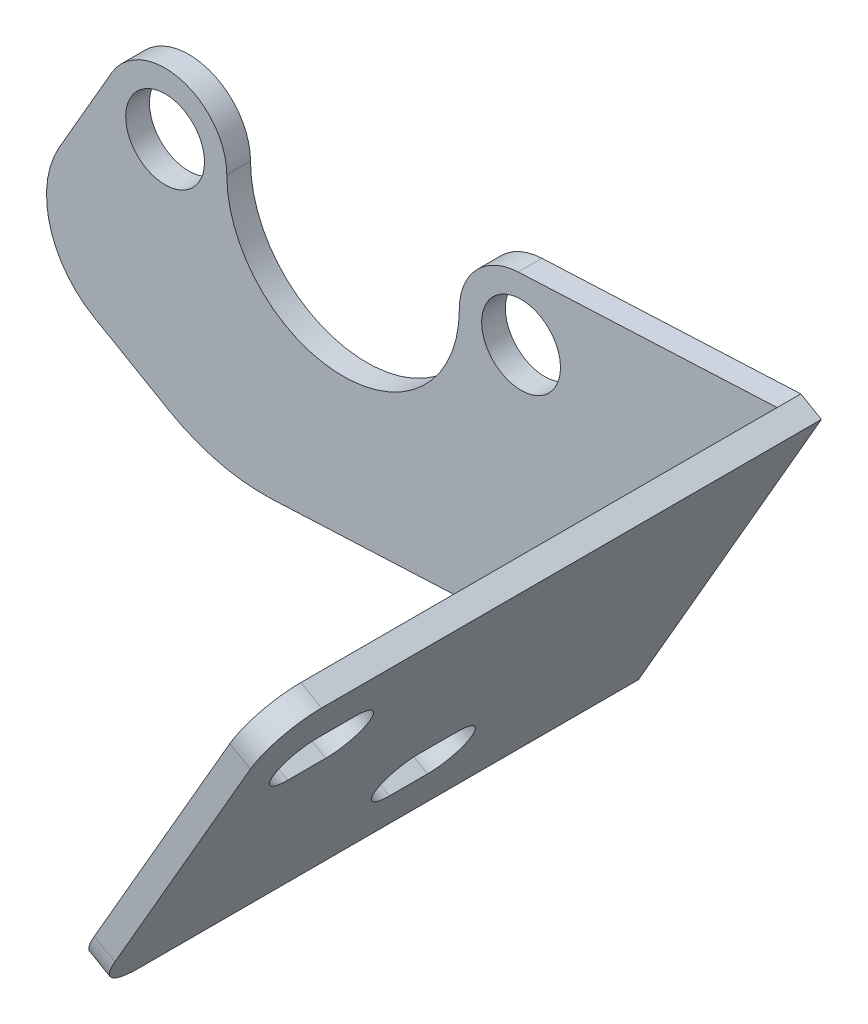
ISO-10303-21;
HEADER;
FILE_DESCRIPTION(('STEP AP214'),'2;1');
FILE_NAME('part.step','',(''),(''),'','','');
FILE_SCHEMA(('AUTOMOTIVE_DESIGN { 1 0 10303 214 1 1 1 1 }'));
ENDSEC;
DATA;
#1=APPLICATION_CONTEXT('core data for automotive mechanical design processes');
#2=APPLICATION_PROTOCOL_DEFINITION('international standard','automotive_design',2000,#1);
#3=PRODUCT_CONTEXT('',#1,'mechanical');
#4=PRODUCT('Part','Part','',(#3));
#5=PRODUCT_RELATED_PRODUCT_CATEGORY('part','',(#4));
#6=PRODUCT_DEFINITION_FORMATION('','',#4);
#7=PRODUCT_DEFINITION_CONTEXT('part definition',#1,'design');
#8=PRODUCT_DEFINITION('design','',#6,#7);
#9=PRODUCT_DEFINITION_SHAPE('','',#8);
#10=(LENGTH_UNIT() NAMED_UNIT(*) SI_UNIT(.MILLI.,.METRE.));
#11=(NAMED_UNIT(*) PLANE_ANGLE_UNIT() SI_UNIT($,.RADIAN.));
#12=(NAMED_UNIT(*) SI_UNIT($,.STERADIAN.) SOLID_ANGLE_UNIT());
#13=UNCERTAINTY_MEASURE_WITH_UNIT(LENGTH_MEASURE(1.E-05),#10,'distance_accuracy_value','');
#14=(GEOMETRIC_REPRESENTATION_CONTEXT(3) GLOBAL_UNCERTAINTY_ASSIGNED_CONTEXT((#13)) GLOBAL_UNIT_ASSIGNED_CONTEXT((#10,
#11,#12)) REPRESENTATION_CONTEXT('',''));
#15=CARTESIAN_POINT('',(0.,0.,0.));
#16=DIRECTION('',(0.,0.,1.));
#17=DIRECTION('',(1.,0.,0.));
#18=AXIS2_PLACEMENT_3D('',#15,#16,#17);
#19=CARTESIAN_POINT('',(0.0124999999997993,1.18749999999891,3.17499999999999));
#20=DIRECTION('',(0.,0.,-1.));
#21=DIRECTION('',(-1.,0.,0.));
#22=AXIS2_PLACEMENT_3D('',#19,#20,#21);
#23=PLANE('',#22);
#24=CARTESIAN_POINT('',(23.825,-0.399999999999684,3.17499999999998));
#25=DIRECTION('',(0.,0.,-1.));
#26=DIRECTION('',(-1.,0.,0.));
#27=AXIS2_PLACEMENT_3D('',#24,#25,#26);
#28=CIRCLE('',#27,5.27050000000111);
#29=CARTESIAN_POINT('',(18.5544999999989,-0.399999999999684,3.17499999999998));
#30=VERTEX_POINT('',#29);
#31=EDGE_CURVE('E340',#30,#30,#28,.T.);
#32=ORIENTED_EDGE('',*,*,#31,.T.);
#33=EDGE_LOOP('',(#32));
#34=FACE_BOUND('',#33,.T.);
#35=CARTESIAN_POINT('',(-23.8,-0.399999999999684,3.17499999999998));
#36=DIRECTION('',(0.,0.,-1.));
#37=DIRECTION('',(-1.,0.,0.));
#38=AXIS2_PLACEMENT_3D('',#35,#36,#37);
#39=CIRCLE('',#38,5.27050000000121);
#40=CARTESIAN_POINT('',(-29.0705000000012,-0.399999999999684,3.17499999999998));
#41=VERTEX_POINT('',#40);
#42=EDGE_CURVE('E284',#41,#41,#39,.T.);
#43=ORIENTED_EDGE('',*,*,#42,.T.);
#44=EDGE_LOOP('',(#43));
#45=FACE_BOUND('',#44,.T.);
#46=DIRECTION('',(-0.86602540378444,0.499999999999997,0.));
#47=VECTOR('',#46,1.);
#48=CARTESIAN_POINT('',(-19.4839165306537,-33.7471333615235,3.17499999999998));
#49=LINE('',#48,#47);
#50=CARTESIAN_POINT('',(-23.2589557120646,-31.5676134739345,3.17499999999998));
#51=VERTEX_POINT('',#50);
#52=CARTESIAN_POINT('',(-33.3112285300745,-25.763931056489,3.17499999999998));
#53=VERTEX_POINT('',#52);
#54=EDGE_CURVE('E306',#51,#53,#49,.T.);
#55=ORIENTED_EDGE('',*,*,#54,.F.);
#56=CARTESIAN_POINT('',(-10.5589557120647,-9.57056821780976,3.17499999999998));
#57=DIRECTION('',(0.,0.,-1.));
#58=DIRECTION('',(-1.,0.,0.));
#59=AXIS2_PLACEMENT_3D('',#56,#57,#58);
#60=CIRCLE('',#59,25.4);
#61=CARTESIAN_POINT('',(-9.37884668488022,-34.9431388933239,3.17499999999998));
#62=VERTEX_POINT('',#61);
#63=EDGE_CURVE('E373',#51,#62,#60,.F.);
#64=ORIENTED_EDGE('',*,*,#63,.T.);
#65=DIRECTION('',(0.998920105335201,0.0464609853222241,0.));
#66=VECTOR('',#65,1.);
#67=CARTESIAN_POINT('',(1.6014940665288,-34.4324299309559,3.17499999999998));
#68=LINE('',#67,#66);
#69=CARTESIAN_POINT('',(33.6033240868605,-32.9439860134507,3.17499999999999));
#70=VERTEX_POINT('',#69);
#71=EDGE_CURVE('E347',#62,#70,#68,.T.);
#72=ORIENTED_EDGE('',*,*,#71,.T.);
#73=DIRECTION('',(-0.500000000000018,-0.866025403784428,0.));
#74=VECTOR('',#73,1.);
#75=CARTESIAN_POINT('',(58.0837409292763,9.45733974807637,3.17499999999999));
#76=LINE('',#75,#74);
#77=CARTESIAN_POINT('',(58.0837409292764,9.45733974807635,3.17499999999998));
#78=VERTEX_POINT('',#77);
#79=EDGE_CURVE('E268',#78,#70,#76,.T.);
#80=ORIENTED_EDGE('',*,*,#79,.F.);
#81=DIRECTION('',(0.998920105335201,0.046460985322224,0.));
#82=VECTOR('',#81,1.);
#83=CARTESIAN_POINT('',(-0.313541912175961,6.74121131451757,3.17499999999998));
#84=LINE('',#83,#82);
#85=CARTESIAN_POINT('',(23.441464566165,7.84608546954351,3.17499999999998));
#86=VERTEX_POINT('',#85);
#87=EDGE_CURVE('E272',#86,#78,#84,.T.);
#88=ORIENTED_EDGE('',*,*,#87,.F.);
#89=CARTESIAN_POINT('',(23.825,-0.399999999999684,3.17499999999998));
#90=DIRECTION('',(0.,0.,-1.));
#91=DIRECTION('',(-1.,0.,0.));
#92=AXIS2_PLACEMENT_3D('',#89,#90,#91);
#93=CIRCLE('',#92,8.25500000000112);
#94=CARTESIAN_POINT('',(15.5700000000014,-0.400000000002455,3.17499999999998));
#95=VERTEX_POINT('',#94);
#96=EDGE_CURVE('E326',#95,#86,#93,.T.);
#97=ORIENTED_EDGE('',*,*,#96,.F.);
#98=CARTESIAN_POINT('',(0.0125000000014374,-0.400000000007677,3.17499999999998));
#99=DIRECTION('',(0.,0.,-1.));
#100=DIRECTION('',(-1.,0.,0.));
#101=AXIS2_PLACEMENT_3D('',#98,#99,#100);
#102=CIRCLE('',#101,15.5575);
#103=CARTESIAN_POINT('',(-15.5449999999988,-0.399999999999613,3.17499999999998));
#104=VERTEX_POINT('',#103);
#105=EDGE_CURVE('E345',#95,#104,#102,.T.);
#106=ORIENTED_EDGE('',*,*,#105,.T.);
#107=CARTESIAN_POINT('',(-23.8,-0.399999999999684,3.17499999999998));
#108=DIRECTION('',(0.,0.,-1.));
#109=DIRECTION('',(-1.,0.,0.));
#110=AXIS2_PLACEMENT_3D('',#107,#108,#109);
#111=CIRCLE('',#110,8.25500000000121);
#112=CARTESIAN_POINT('',(-30.9490397082387,3.72750000000045,3.17499999999998));
#113=VERTEX_POINT('',#112);
#114=EDGE_CURVE('E330',#113,#104,#111,.T.);
#115=ORIENTED_EDGE('',*,*,#114,.F.);
#116=DIRECTION('',(0.500000000000046,0.866025403784413,0.));
#117=VECTOR('',#116,1.);
#118=CARTESIAN_POINT('',(-24.8258346274812,14.3332023050351,3.17499999999998));
#119=LINE('',#118,#117);
#120=CARTESIAN_POINT('',(-37.9597511581366,-8.41540842842607,3.17499999999998));
#121=VERTEX_POINT('',#120);
#122=EDGE_CURVE('E314',#121,#113,#119,.T.);
#123=ORIENTED_EDGE('',*,*,#122,.F.);
#124=CARTESIAN_POINT('',(-26.9612285300746,-14.7654084284266,3.17499999999998));
#125=DIRECTION('',(0.,0.,-1.));
#126=DIRECTION('',(-1.,0.,0.));
#127=AXIS2_PLACEMENT_3D('',#124,#125,#126);
#128=CIRCLE('',#127,12.7);
#129=EDGE_CURVE('E363',#121,#53,#128,.F.);
#130=ORIENTED_EDGE('',*,*,#129,.T.);
#131=EDGE_LOOP('',(#55,#64,#72,#80,#88,#97,#106,#115,#123,#130));
#132=FACE_BOUND('',#131,.T.);
#133=ADVANCED_FACE('F40',(#34,#45,#132),#23,.F.);
#134=CARTESIAN_POINT('',(-0.313541912175961,6.74121131451757,117.443565280945));
#135=DIRECTION('',(0.046460985322224,-0.998920105335201,0.));
#136=DIRECTION('',(0.998920105335201,0.046460985322224,0.));
#137=AXIS2_PLACEMENT_3D('',#134,#135,#136);
#138=PLANE('',#137);
#139=DIRECTION('',(0.,0.,-1.));
#140=VECTOR('',#139,1.);
#141=CARTESIAN_POINT('',(23.441464566165,7.84608546954295,117.443565280945));
#142=LINE('',#141,#140);
#143=CARTESIAN_POINT('',(23.441464566165,7.84608546954295,0.));
#144=VERTEX_POINT('',#143);
#145=EDGE_CURVE('E322',#86,#144,#142,.T.);
#146=ORIENTED_EDGE('',*,*,#145,.F.);
#147=ORIENTED_EDGE('',*,*,#87,.T.);
#148=DIRECTION('',(0.,0.,-1.));
#149=VECTOR('',#148,1.);
#150=CARTESIAN_POINT('',(58.0837409292764,9.45733974807636,117.443565280945));
#151=LINE('',#150,#149);
#152=CARTESIAN_POINT('',(58.0837409292764,9.45733974807636,0.));
#153=VERTEX_POINT('',#152);
#154=EDGE_CURVE('E327',#78,#153,#151,.T.);
#155=ORIENTED_EDGE('',*,*,#154,.T.);
#156=DIRECTION('',(-0.998920105335201,-0.046460985322224,0.));
#157=VECTOR('',#156,1.);
#158=CARTESIAN_POINT('',(-0.313541912175961,6.74121131451757,0.));
#159=LINE('',#158,#157);
#160=EDGE_CURVE('E323',#153,#144,#159,.T.);
#161=ORIENTED_EDGE('',*,*,#160,.T.);
#162=EDGE_LOOP('',(#146,#147,#155,#161));
#163=FACE_BOUND('',#162,.T.);
#164=ADVANCED_FACE('F410',(#163),#138,.F.);
#165=CARTESIAN_POINT('',(23.825,-0.399999999999684,117.443565280945));
#166=DIRECTION('',(0.,0.,-1.));
#167=DIRECTION('',(-1.,0.,0.));
#168=AXIS2_PLACEMENT_3D('',#165,#166,#167);
#169=CYLINDRICAL_SURFACE('',#168,8.25500000000112);
#170=DIRECTION('',(0.,0.,-1.));
#171=VECTOR('',#170,1.);
#172=CARTESIAN_POINT('',(15.5699999999993,-0.400000000002455,117.443565280945));
#173=LINE('',#172,#171);
#174=CARTESIAN_POINT('',(15.5699999999993,-0.400000000002455,0.));
#175=VERTEX_POINT('',#174);
#176=EDGE_CURVE('E321',#95,#175,#173,.T.);
#177=ORIENTED_EDGE('',*,*,#176,.F.);
#178=ORIENTED_EDGE('',*,*,#96,.T.);
#179=ORIENTED_EDGE('',*,*,#145,.T.);
#180=CARTESIAN_POINT('',(23.825,-0.399999999999684,0.));
#181=DIRECTION('',(0.,0.,1.));
#182=DIRECTION('',(1.,0.,0.));
#183=AXIS2_PLACEMENT_3D('',#180,#181,#182);
#184=CIRCLE('',#183,8.25500000000112);
#185=EDGE_CURVE('E318',#144,#175,#184,.T.);
#186=ORIENTED_EDGE('',*,*,#185,.T.);
#187=EDGE_LOOP('',(#177,#178,#179,#186));
#188=FACE_BOUND('',#187,.T.);
#189=ADVANCED_FACE('F428',(#188),#169,.T.);
#190=CARTESIAN_POINT('',(0.0125000000014374,-0.400000000007677,117.443565280945));
#191=DIRECTION('',(0.,0.,-1.));
#192=DIRECTION('',(-1.,0.,0.));
#193=AXIS2_PLACEMENT_3D('',#190,#191,#192);
#194=CYLINDRICAL_SURFACE('',#193,15.5575);
#195=ORIENTED_EDGE('',*,*,#105,.F.);
#196=ORIENTED_EDGE('',*,*,#176,.T.);
#197=CARTESIAN_POINT('',(0.0125000000014374,-0.400000000007677,0.));
#198=DIRECTION('',(0.,0.,1.));
#199=DIRECTION('',(1.,0.,0.));
#200=AXIS2_PLACEMENT_3D('',#197,#198,#199);
#201=CIRCLE('',#200,15.5575);
#202=CARTESIAN_POINT('',(-15.5449999999987,-0.399999999999613,0.));
#203=VERTEX_POINT('',#202);
#204=EDGE_CURVE('E288',#203,#175,#201,.T.);
#205=ORIENTED_EDGE('',*,*,#204,.F.);
#206=DIRECTION('',(0.,0.,-1.));
#207=VECTOR('',#206,1.);
#208=CARTESIAN_POINT('',(-15.5449999999987,-0.399999999999613,117.443565280945));
#209=LINE('',#208,#207);
#210=EDGE_CURVE('E315',#104,#203,#209,.T.);
#211=ORIENTED_EDGE('',*,*,#210,.F.);
#212=EDGE_LOOP('',(#195,#196,#205,#211));
#213=FACE_BOUND('',#212,.T.);
#214=ADVANCED_FACE('F432',(#213),#194,.F.);
#215=CARTESIAN_POINT('',(-23.8,-0.399999999999684,117.443565280945));
#216=DIRECTION('',(0.,0.,-1.));
#217=DIRECTION('',(-1.,0.,0.));
#218=AXIS2_PLACEMENT_3D('',#215,#216,#217);
#219=CYLINDRICAL_SURFACE('',#218,8.25500000000121);
#220=DIRECTION('',(0.,0.,-1.));
#221=VECTOR('',#220,1.);
#222=CARTESIAN_POINT('',(-30.9490397082403,3.72750000000045,117.443565280945));
#223=LINE('',#222,#221);
#224=CARTESIAN_POINT('',(-30.9490397082403,3.72750000000045,0.));
#225=VERTEX_POINT('',#224);
#226=EDGE_CURVE('E310',#113,#225,#223,.T.);
#227=ORIENTED_EDGE('',*,*,#226,.F.);
#228=ORIENTED_EDGE('',*,*,#114,.T.);
#229=ORIENTED_EDGE('',*,*,#210,.T.);
#230=CARTESIAN_POINT('',(-23.8,-0.399999999999684,0.));
#231=DIRECTION('',(0.,0.,1.));
#232=DIRECTION('',(1.,0.,0.));
#233=AXIS2_PLACEMENT_3D('',#230,#231,#232);
#234=CIRCLE('',#233,8.25500000000121);
#235=EDGE_CURVE('E311',#203,#225,#234,.T.);
#236=ORIENTED_EDGE('',*,*,#235,.T.);
#237=EDGE_LOOP('',(#227,#228,#229,#236));
#238=FACE_BOUND('',#237,.T.);
#239=ADVANCED_FACE('F438',(#238),#219,.T.);
#240=CARTESIAN_POINT('',(-24.8258346274812,14.3332023050351,117.443565280945));
#241=DIRECTION('',(0.866025403784413,-0.500000000000046,0.));
#242=DIRECTION('',(0.500000000000046,0.866025403784413,0.));
#243=AXIS2_PLACEMENT_3D('',#240,#241,#242);
#244=PLANE('',#243);
#245=DIRECTION('',(-0.500000000000046,-0.866025403784413,0.));
#246=VECTOR('',#245,1.);
#247=CARTESIAN_POINT('',(-24.8258346274812,14.3332023050351,0.));
#248=LINE('',#247,#246);
#249=CARTESIAN_POINT('',(-37.9597511581366,-8.41540842842607,0.));
#250=VERTEX_POINT('',#249);
#251=EDGE_CURVE('E307',#225,#250,#248,.T.);
#252=ORIENTED_EDGE('',*,*,#251,.T.);
#253=DIRECTION('',(0.,0.,-1.));
#254=VECTOR('',#253,1.);
#255=CARTESIAN_POINT('',(-37.9597511581366,-8.41540842842606,117.443565280945));
#256=LINE('',#255,#254);
#257=EDGE_CURVE('E361',#250,#121,#256,.F.);
#258=ORIENTED_EDGE('',*,*,#257,.T.);
#259=ORIENTED_EDGE('',*,*,#122,.T.);
#260=ORIENTED_EDGE('',*,*,#226,.T.);
#261=EDGE_LOOP('',(#252,#258,#259,#260));
#262=FACE_BOUND('',#261,.T.);
#263=ADVANCED_FACE('F441',(#262),#244,.F.);
#264=CARTESIAN_POINT('',(-19.4839165306537,-33.7471333615235,117.443565280945));
#265=DIRECTION('',(0.499999999999997,0.86602540378444,0.));
#266=DIRECTION('',(-0.86602540378444,0.499999999999997,0.));
#267=AXIS2_PLACEMENT_3D('',#264,#265,#266);
#268=PLANE('',#267);
#269=DIRECTION('',(0.86602540378444,-0.499999999999997,0.));
#270=VECTOR('',#269,1.);
#271=CARTESIAN_POINT('',(-19.4839165306537,-33.7471333615235,0.));
#272=LINE('',#271,#270);
#273=CARTESIAN_POINT('',(-33.3112285300745,-25.763931056489,0.));
#274=VERTEX_POINT('',#273);
#275=CARTESIAN_POINT('',(-23.2589557120646,-31.5676134739345,0.));
#276=VERTEX_POINT('',#275);
#277=EDGE_CURVE('E302',#274,#276,#272,.T.);
#278=ORIENTED_EDGE('',*,*,#277,.T.);
#279=DIRECTION('',(0.,0.,-1.));
#280=VECTOR('',#279,1.);
#281=CARTESIAN_POINT('',(-23.2589557120646,-31.5676134739345,3.17499999999998));
#282=LINE('',#281,#280);
#283=EDGE_CURVE('E371',#276,#51,#282,.F.);
#284=ORIENTED_EDGE('',*,*,#283,.T.);
#285=ORIENTED_EDGE('',*,*,#54,.T.);
#286=DIRECTION('',(0.,0.,-1.));
#287=VECTOR('',#286,1.);
#288=CARTESIAN_POINT('',(-33.3112285300745,-25.763931056489,117.443565280945));
#289=LINE('',#288,#287);
#290=EDGE_CURVE('E354',#53,#274,#289,.T.);
#291=ORIENTED_EDGE('',*,*,#290,.T.);
#292=EDGE_LOOP('',(#278,#284,#285,#291));
#293=FACE_BOUND('',#292,.T.);
#294=ADVANCED_FACE('F451',(#293),#268,.F.);
#295=CARTESIAN_POINT('',(1.6014940665288,-34.4324299309559,117.443565280945));
#296=DIRECTION('',(0.0464609853222241,-0.998920105335201,0.));
#297=DIRECTION('',(0.998920105335201,0.0464609853222241,0.));
#298=AXIS2_PLACEMENT_3D('',#295,#296,#297);
#299=PLANE('',#298);
#300=ORIENTED_EDGE('',*,*,#71,.F.);
#301=DIRECTION('',(0.,0.,-1.));
#302=VECTOR('',#301,1.);
#303=CARTESIAN_POINT('',(-9.37884668488021,-34.9431388933239,0.));
#304=LINE('',#303,#302);
#305=CARTESIAN_POINT('',(-9.37884668488022,-34.9431388933239,0.));
#306=VERTEX_POINT('',#305);
#307=EDGE_CURVE('E366',#62,#306,#304,.T.);
#308=ORIENTED_EDGE('',*,*,#307,.T.);
#309=DIRECTION('',(-0.998920105335201,-0.0464609853222241,0.));
#310=VECTOR('',#309,1.);
#311=CARTESIAN_POINT('',(1.6014940665288,-34.4324299309559,0.));
#312=LINE('',#311,#310);
#313=CARTESIAN_POINT('',(33.6033240868612,-32.9439860134516,0.));
#314=VERTEX_POINT('',#313);
#315=EDGE_CURVE('E299',#314,#306,#312,.T.);
#316=ORIENTED_EDGE('',*,*,#315,.F.);
#317=DIRECTION('',(0.,0.,-1.));
#318=VECTOR('',#317,1.);
#319=CARTESIAN_POINT('',(33.6033240868612,-32.9439860134516,117.443565280945));
#320=LINE('',#319,#318);
#321=EDGE_CURVE('E305',#70,#314,#320,.T.);
#322=ORIENTED_EDGE('',*,*,#321,.F.);
#323=EDGE_LOOP('',(#300,#308,#316,#322));
#324=FACE_BOUND('',#323,.T.);
#325=ADVANCED_FACE('F420',(#324),#299,.T.);
#326=CARTESIAN_POINT('',(-5.86433337306996,-10.157323354681,117.443565280945));
#327=DIRECTION('',(-0.499999999999923,-0.866025403784483,0.));
#328=DIRECTION('',(0.866025403784483,-0.499999999999923,0.));
#329=AXIS2_PLACEMENT_3D('',#326,#327,#328);
#330=PLANE('',#329);
#331=DIRECTION('',(0.,0.,-1.));
#332=VECTOR('',#331,1.);
#333=CARTESIAN_POINT('',(36.3529547438761,-34.5314860134508,117.443565280945));
#334=LINE('',#333,#332);
#335=CARTESIAN_POINT('',(36.3529547438761,-34.5314860134508,66.8750000000011));
#336=VERTEX_POINT('',#335);
#337=CARTESIAN_POINT('',(36.3529547438761,-34.5314860134508,0.));
#338=VERTEX_POINT('',#337);
#339=EDGE_CURVE('E334',#336,#338,#334,.T.);
#340=ORIENTED_EDGE('',*,*,#339,.F.);
#341=DIRECTION('',(-0.866025403784483,0.499999999999923,0.));
#342=VECTOR('',#341,1.);
#343=CARTESIAN_POINT('',(33.6033240868603,-32.9439860134511,66.8750000000011));
#344=LINE('',#343,#342);
#345=CARTESIAN_POINT('',(33.6033240868605,-32.9439860134507,66.8750000000011));
#346=VERTEX_POINT('',#345);
#347=EDGE_CURVE('E375',#336,#346,#344,.T.);
#348=ORIENTED_EDGE('',*,*,#347,.T.);
#349=DIRECTION('',(0.,0.,-1.));
#350=VECTOR('',#349,1.);
#351=CARTESIAN_POINT('',(33.6033240868605,-32.9439860134507,124.959826555227));
#352=LINE('',#351,#350);
#353=EDGE_CURVE('E276',#346,#70,#352,.T.);
#354=ORIENTED_EDGE('',*,*,#353,.T.);
#355=ORIENTED_EDGE('',*,*,#321,.T.);
#356=DIRECTION('',(-0.866025403784483,0.499999999999923,0.));
#357=VECTOR('',#356,1.);
#358=CARTESIAN_POINT('',(-5.86433337306996,-10.157323354681,0.));
#359=LINE('',#358,#357);
#360=EDGE_CURVE('E296',#338,#314,#359,.T.);
#361=ORIENTED_EDGE('',*,*,#360,.F.);
#362=EDGE_LOOP('',(#340,#348,#354,#355,#361));
#363=FACE_BOUND('',#362,.T.);
#364=ADVANCED_FACE('F394',(#363),#330,.T.);
#365=CARTESIAN_POINT('',(42.2172881169445,-24.374162658775,117.443565280945));
#366=DIRECTION('',(0.866025403784428,-0.500000000000018,0.));
#367=DIRECTION('',(0.500000000000018,0.866025403784428,0.));
#368=AXIS2_PLACEMENT_3D('',#365,#366,#367);
#369=PLANE('',#368);
#370=DIRECTION('',(0.,0.,-1.));
#371=VECTOR('',#370,1.);
#372=CARTESIAN_POINT('',(52.4989965862917,-6.56572120125533,117.443565280945));
#373=LINE('',#372,#371);
#374=CARTESIAN_POINT('',(52.4989965862916,-6.56572120125538,63.0650000000011));
#375=VERTEX_POINT('',#374);
#376=CARTESIAN_POINT('',(52.4989965862916,-6.56572120125539,57.9850000000011));
#377=VERTEX_POINT('',#376);
#378=EDGE_CURVE('E266',#375,#377,#373,.T.);
#379=ORIENTED_EDGE('',*,*,#378,.F.);
#380=CARTESIAN_POINT('',(54.4833715862917,-3.12868287998594,63.0650000000011));
#381=DIRECTION('',(0.866025403784428,-0.500000000000018,0.));
#382=DIRECTION('',(0.500000000000018,0.866025403784428,0.));
#383=AXIS2_PLACEMENT_3D('',#380,#381,#382);
#384=CIRCLE('',#383,3.96874999999999);
#385=CARTESIAN_POINT('',(56.4677465862918,0.308355441283505,63.0650000000011));
#386=VERTEX_POINT('',#385);
#387=EDGE_CURVE('E261',#386,#375,#384,.T.);
#388=ORIENTED_EDGE('',*,*,#387,.F.);
#389=DIRECTION('',(0.,0.,-1.));
#390=VECTOR('',#389,1.);
#391=CARTESIAN_POINT('',(56.4677465862918,0.308355441283506,117.443565280945));
#392=LINE('',#391,#390);
#393=CARTESIAN_POINT('',(56.4677465862918,0.308355441283507,57.9850000000011));
#394=VERTEX_POINT('',#393);
#395=EDGE_CURVE('E205',#386,#394,#392,.T.);
#396=ORIENTED_EDGE('',*,*,#395,.T.);
#397=CARTESIAN_POINT('',(54.4833715862917,-3.12868287998594,57.9850000000011));
#398=DIRECTION('',(0.866025403784428,-0.500000000000018,0.));
#399=DIRECTION('',(0.500000000000018,0.866025403784428,0.));
#400=AXIS2_PLACEMENT_3D('',#397,#398,#399);
#401=CIRCLE('',#400,3.96875);
#402=EDGE_CURVE('E264',#377,#394,#401,.T.);
#403=ORIENTED_EDGE('',*,*,#402,.F.);
#404=EDGE_LOOP('',(#379,#388,#396,#403));
#405=FACE_BOUND('',#404,.T.);
#406=DIRECTION('',(0.,0.,-1.));
#407=VECTOR('',#406,1.);
#408=CARTESIAN_POINT('',(40.7185797438762,-26.970001706658,117.443565280945));
#409=LINE('',#408,#407);
#410=CARTESIAN_POINT('',(40.7185797438762,-26.970001706658,37.6650000000014));
#411=VERTEX_POINT('',#410);
#412=CARTESIAN_POINT('',(40.7185797438762,-26.970001706658,32.5850000000014));
#413=VERTEX_POINT('',#412);
#414=EDGE_CURVE('E259',#411,#413,#409,.T.);
#415=ORIENTED_EDGE('',*,*,#414,.F.);
#416=CARTESIAN_POINT('',(42.7029547438763,-23.5329633853885,37.6650000000014));
#417=DIRECTION('',(0.866025403784428,-0.500000000000018,0.));
#418=DIRECTION('',(0.500000000000018,0.866025403784428,0.));
#419=AXIS2_PLACEMENT_3D('',#416,#417,#418);
#420=CIRCLE('',#419,3.96875);
#421=CARTESIAN_POINT('',(44.6873297438764,-20.0959250641191,37.6650000000014));
#422=VERTEX_POINT('',#421);
#423=EDGE_CURVE('E230',#422,#411,#420,.T.);
#424=ORIENTED_EDGE('',*,*,#423,.F.);
#425=DIRECTION('',(0.,0.,-1.));
#426=VECTOR('',#425,1.);
#427=CARTESIAN_POINT('',(44.6873297438764,-20.0959250641191,117.443565280945));
#428=LINE('',#427,#426);
#429=CARTESIAN_POINT('',(44.6873297438764,-20.0959250641191,32.5850000000014));
#430=VERTEX_POINT('',#429);
#431=EDGE_CURVE('E254',#422,#430,#428,.T.);
#432=ORIENTED_EDGE('',*,*,#431,.T.);
#433=CARTESIAN_POINT('',(42.7029547438763,-23.5329633853885,32.5850000000014));
#434=DIRECTION('',(0.866025403784428,-0.500000000000018,0.));
#435=DIRECTION('',(0.500000000000018,0.866025403784428,0.));
#436=AXIS2_PLACEMENT_3D('',#433,#434,#435);
#437=CIRCLE('',#436,3.96875);
#438=EDGE_CURVE('E257',#413,#430,#437,.T.);
#439=ORIENTED_EDGE('',*,*,#438,.F.);
#440=EDGE_LOOP('',(#415,#424,#432,#439));
#441=FACE_BOUND('',#440,.T.);
#442=DIRECTION('',(-0.500000000000018,-0.866025403784428,0.));
#443=VECTOR('',#442,1.);
#444=CARTESIAN_POINT('',(60.833371586292,7.86983974807643,73.2250000000011));
#445=LINE('',#444,#443);
#446=CARTESIAN_POINT('',(57.6583715862918,2.37057843404524,73.2250000000011));
#447=VERTEX_POINT('',#446);
#448=CARTESIAN_POINT('',(39.5279547438762,-29.0322246994197,73.2250000000011));
#449=VERTEX_POINT('',#448);
#450=EDGE_CURVE('E273',#447,#449,#445,.T.);
#451=ORIENTED_EDGE('',*,*,#450,.T.);
#452=CARTESIAN_POINT('',(39.5279547438762,-29.0322246994197,66.8750000000011));
#453=DIRECTION('',(0.866025403784428,-0.500000000000018,0.));
#454=DIRECTION('',(0.500000000000018,0.866025403784428,0.));
#455=AXIS2_PLACEMENT_3D('',#452,#453,#454);
#456=CIRCLE('',#455,6.35);
#457=EDGE_CURVE('E48',#449,#336,#456,.T.);
#458=ORIENTED_EDGE('',*,*,#457,.T.);
#459=ORIENTED_EDGE('',*,*,#339,.T.);
#460=DIRECTION('',(-0.500000000000018,-0.866025403784428,0.));
#461=VECTOR('',#460,1.);
#462=CARTESIAN_POINT('',(42.2172881169445,-24.374162658775,0.));
#463=LINE('',#462,#461);
#464=CARTESIAN_POINT('',(60.833371586292,7.86983974807637,0.));
#465=VERTEX_POINT('',#464);
#466=EDGE_CURVE('E292',#465,#338,#463,.T.);
#467=ORIENTED_EDGE('',*,*,#466,.F.);
#468=DIRECTION('',(0.,0.,-1.));
#469=VECTOR('',#468,1.);
#470=CARTESIAN_POINT('',(60.833371586292,7.86983974807637,117.443565280945));
#471=LINE('',#470,#469);
#472=CARTESIAN_POINT('',(60.833371586292,7.86983974807637,66.8750000000012));
#473=VERTEX_POINT('',#472);
#474=EDGE_CURVE('E293',#473,#465,#471,.T.);
#475=ORIENTED_EDGE('',*,*,#474,.F.);
#476=CARTESIAN_POINT('',(57.6583715862918,2.37057843404524,66.8750000000012));
#477=DIRECTION('',(0.866025403784428,-0.500000000000018,0.));
#478=DIRECTION('',(0.500000000000018,0.866025403784428,0.));
#479=AXIS2_PLACEMENT_3D('',#476,#477,#478);
#480=CIRCLE('',#479,6.35);
#481=EDGE_CURVE('E55',#473,#447,#480,.T.);
#482=ORIENTED_EDGE('',*,*,#481,.T.);
#483=EDGE_LOOP('',(#451,#458,#459,#467,#475,#482));
#484=FACE_BOUND('',#483,.T.);
#485=ADVANCED_FACE('F388',(#405,#441,#484),#369,.T.);
#486=CARTESIAN_POINT('',(-23.8,-0.399999999999684,117.443565280945));
#487=DIRECTION('',(0.,0.,-1.));
#488=DIRECTION('',(-1.,0.,0.));
#489=AXIS2_PLACEMENT_3D('',#486,#487,#488);
#490=CYLINDRICAL_SURFACE('',#489,5.27050000000121);
#491=ORIENTED_EDGE('',*,*,#42,.F.);
#492=EDGE_LOOP('',(#491));
#493=FACE_BOUND('',#492,.T.);
#494=CARTESIAN_POINT('',(-23.8,-0.399999999999684,0.));
#495=DIRECTION('',(0.,0.,1.));
#496=DIRECTION('',(1.,0.,0.));
#497=AXIS2_PLACEMENT_3D('',#494,#495,#496);
#498=CIRCLE('',#497,5.27050000000121);
#499=CARTESIAN_POINT('',(-18.5294999999988,-0.399999999999684,0.));
#500=VERTEX_POINT('',#499);
#501=EDGE_CURVE('E285',#500,#500,#498,.T.);
#502=ORIENTED_EDGE('',*,*,#501,.F.);
#503=EDGE_LOOP('',(#502));
#504=FACE_BOUND('',#503,.T.);
#505=ADVANCED_FACE('F513',(#493,#504),#490,.F.);
#506=CARTESIAN_POINT('',(18.6160834693462,32.2440024068509,117.443565280945));
#507=DIRECTION('',(-0.499999999999998,-0.86602540378444,0.));
#508=DIRECTION('',(0.86602540378444,-0.499999999999998,0.));
#509=AXIS2_PLACEMENT_3D('',#506,#507,#508);
#510=PLANE('',#509);
#511=DIRECTION('',(0.,0.,-1.));
#512=VECTOR('',#511,1.);
#513=CARTESIAN_POINT('',(58.0837409292763,9.45733974807637,124.959826555227));
#514=LINE('',#513,#512);
#515=CARTESIAN_POINT('',(58.0837409292763,9.45733974807637,66.8750000000012));
#516=VERTEX_POINT('',#515);
#517=EDGE_CURVE('E278',#516,#78,#514,.T.);
#518=ORIENTED_EDGE('',*,*,#517,.F.);
#519=DIRECTION('',(0.86602540378444,-0.499999999999998,0.));
#520=VECTOR('',#519,1.);
#521=CARTESIAN_POINT('',(18.6160834693462,32.2440024068509,66.8750000000012));
#522=LINE('',#521,#520);
#523=EDGE_CURVE('E11',#516,#473,#522,.T.);
#524=ORIENTED_EDGE('',*,*,#523,.T.);
#525=ORIENTED_EDGE('',*,*,#474,.T.);
#526=DIRECTION('',(-0.86602540378444,0.499999999999998,0.));
#527=VECTOR('',#526,1.);
#528=CARTESIAN_POINT('',(18.6160834693462,32.2440024068509,0.));
#529=LINE('',#528,#527);
#530=EDGE_CURVE('E289',#465,#153,#529,.T.);
#531=ORIENTED_EDGE('',*,*,#530,.T.);
#532=ORIENTED_EDGE('',*,*,#154,.F.);
#533=EDGE_LOOP('',(#518,#524,#525,#531,#532));
#534=FACE_BOUND('',#533,.T.);
#535=ADVANCED_FACE('F404',(#534),#510,.F.);
#536=CARTESIAN_POINT('',(23.825,-0.399999999999684,117.443565280945));
#537=DIRECTION('',(0.,0.,-1.));
#538=DIRECTION('',(-1.,0.,0.));
#539=AXIS2_PLACEMENT_3D('',#536,#537,#538);
#540=CYLINDRICAL_SURFACE('',#539,5.27050000000111);
#541=ORIENTED_EDGE('',*,*,#31,.F.);
#542=EDGE_LOOP('',(#541));
#543=FACE_BOUND('',#542,.T.);
#544=CARTESIAN_POINT('',(23.825,-0.399999999999684,0.));
#545=DIRECTION('',(0.,0.,1.));
#546=DIRECTION('',(1.,0.,0.));
#547=AXIS2_PLACEMENT_3D('',#544,#545,#546);
#548=CIRCLE('',#547,5.27050000000111);
#549=CARTESIAN_POINT('',(29.0955000000011,-0.399999999999684,0.));
#550=VERTEX_POINT('',#549);
#551=EDGE_CURVE('E281',#550,#550,#548,.T.);
#552=ORIENTED_EDGE('',*,*,#551,.F.);
#553=EDGE_LOOP('',(#552));
#554=FACE_BOUND('',#553,.T.);
#555=ADVANCED_FACE('F470',(#543,#554),#540,.F.);
#556=CARTESIAN_POINT('',(0.,0.,0.));
#557=DIRECTION('',(0.,0.,1.));
#558=DIRECTION('',(1.,0.,0.));
#559=AXIS2_PLACEMENT_3D('',#556,#557,#558);
#560=PLANE('',#559);
#561=ORIENTED_EDGE('',*,*,#315,.T.);
#562=CARTESIAN_POINT('',(-10.5589557120647,-9.57056821780976,0.));
#563=DIRECTION('',(0.,0.,1.));
#564=DIRECTION('',(1.,0.,0.));
#565=AXIS2_PLACEMENT_3D('',#562,#563,#564);
#566=CIRCLE('',#565,25.4);
#567=EDGE_CURVE('E369',#306,#276,#566,.F.);
#568=ORIENTED_EDGE('',*,*,#567,.T.);
#569=ORIENTED_EDGE('',*,*,#277,.F.);
#570=CARTESIAN_POINT('',(-26.9612285300746,-14.7654084284266,0.));
#571=DIRECTION('',(0.,0.,1.));
#572=DIRECTION('',(1.,0.,0.));
#573=AXIS2_PLACEMENT_3D('',#570,#571,#572);
#574=CIRCLE('',#573,12.7);
#575=EDGE_CURVE('E359',#274,#250,#574,.F.);
#576=ORIENTED_EDGE('',*,*,#575,.T.);
#577=ORIENTED_EDGE('',*,*,#251,.F.);
#578=ORIENTED_EDGE('',*,*,#235,.F.);
#579=ORIENTED_EDGE('',*,*,#204,.T.);
#580=ORIENTED_EDGE('',*,*,#185,.F.);
#581=ORIENTED_EDGE('',*,*,#160,.F.);
#582=ORIENTED_EDGE('',*,*,#530,.F.);
#583=ORIENTED_EDGE('',*,*,#466,.T.);
#584=ORIENTED_EDGE('',*,*,#360,.T.);
#585=EDGE_LOOP('',(#561,#568,#569,#576,#577,#578,#579,#580,#581,#582,#583,#584));
#586=FACE_BOUND('',#585,.T.);
#587=ORIENTED_EDGE('',*,*,#501,.T.);
#588=EDGE_LOOP('',(#587));
#589=FACE_BOUND('',#588,.T.);
#590=ORIENTED_EDGE('',*,*,#551,.T.);
#591=EDGE_LOOP('',(#590));
#592=FACE_BOUND('',#591,.T.);
#593=ADVANCED_FACE('F422',(#586,#589,#592),#560,.F.);
#594=CARTESIAN_POINT('',(58.0837409292763,9.45733974807637,124.959826555227));
#595=DIRECTION('',(0.866025403784428,-0.500000000000018,0.));
#596=DIRECTION('',(0.500000000000018,0.866025403784428,0.));
#597=AXIS2_PLACEMENT_3D('',#594,#595,#596);
#598=PLANE('',#597);
#599=CARTESIAN_POINT('',(51.7337409292761,-1.54118287998587,63.0650000000011));
#600=DIRECTION('',(-0.866025403784428,0.500000000000018,0.));
#601=DIRECTION('',(-0.500000000000018,-0.866025403784428,0.));
#602=AXIS2_PLACEMENT_3D('',#599,#600,#601);
#603=CIRCLE('',#602,3.96874999999999);
#604=CARTESIAN_POINT('',(49.749365929276,-4.97822120125532,63.0650000000011));
#605=VERTEX_POINT('',#604);
#606=CARTESIAN_POINT('',(53.7181159292762,1.89585544128357,63.0650000000011));
#607=VERTEX_POINT('',#606);
#608=EDGE_CURVE('E213',#605,#607,#603,.T.);
#609=ORIENTED_EDGE('',*,*,#608,.F.);
#610=DIRECTION('',(0.,0.,1.));
#611=VECTOR('',#610,1.);
#612=CARTESIAN_POINT('',(49.749365929276,-4.97822120125538,0.));
#613=LINE('',#612,#611);
#614=CARTESIAN_POINT('',(49.749365929276,-4.97822120125532,57.9850000000011));
#615=VERTEX_POINT('',#614);
#616=EDGE_CURVE('E218',#615,#605,#613,.T.);
#617=ORIENTED_EDGE('',*,*,#616,.F.);
#618=CARTESIAN_POINT('',(51.7337409292761,-1.54118287998587,57.9850000000011));
#619=DIRECTION('',(-0.866025403784428,0.500000000000018,0.));
#620=DIRECTION('',(-0.500000000000018,-0.866025403784428,0.));
#621=AXIS2_PLACEMENT_3D('',#618,#619,#620);
#622=CIRCLE('',#621,3.96875);
#623=CARTESIAN_POINT('',(53.7181159292762,1.89585544128357,57.9850000000011));
#624=VERTEX_POINT('',#623);
#625=EDGE_CURVE('E223',#624,#615,#622,.T.);
#626=ORIENTED_EDGE('',*,*,#625,.F.);
#627=DIRECTION('',(0.,0.,1.));
#628=VECTOR('',#627,1.);
#629=CARTESIAN_POINT('',(53.7181159292762,1.89585544128357,0.));
#630=LINE('',#629,#628);
#631=EDGE_CURVE('E202',#624,#607,#630,.T.);
#632=ORIENTED_EDGE('',*,*,#631,.T.);
#633=EDGE_LOOP('',(#609,#617,#626,#632));
#634=FACE_BOUND('',#633,.T.);
#635=CARTESIAN_POINT('',(39.9533240868607,-21.9454633853885,37.6650000000014));
#636=DIRECTION('',(-0.866025403784428,0.500000000000018,0.));
#637=DIRECTION('',(-0.500000000000018,-0.866025403784428,0.));
#638=AXIS2_PLACEMENT_3D('',#635,#636,#637);
#639=CIRCLE('',#638,3.96875);
#640=CARTESIAN_POINT('',(37.9689490868607,-25.3825017066579,37.6650000000014));
#641=VERTEX_POINT('',#640);
#642=CARTESIAN_POINT('',(41.9376990868608,-18.508425064119,37.6650000000014));
#643=VERTEX_POINT('',#642);
#644=EDGE_CURVE('E235',#641,#643,#639,.T.);
#645=ORIENTED_EDGE('',*,*,#644,.F.);
#646=DIRECTION('',(0.,0.,1.));
#647=VECTOR('',#646,1.);
#648=CARTESIAN_POINT('',(37.9689490868606,-25.382501706658,0.));
#649=LINE('',#648,#647);
#650=CARTESIAN_POINT('',(37.9689490868607,-25.3825017066579,32.5850000000014));
#651=VERTEX_POINT('',#650);
#652=EDGE_CURVE('E233',#651,#641,#649,.T.);
#653=ORIENTED_EDGE('',*,*,#652,.F.);
#654=CARTESIAN_POINT('',(39.9533240868607,-21.9454633853885,32.5850000000014));
#655=DIRECTION('',(-0.866025403784428,0.500000000000018,0.));
#656=DIRECTION('',(-0.500000000000018,-0.866025403784428,0.));
#657=AXIS2_PLACEMENT_3D('',#654,#655,#656);
#658=CIRCLE('',#657,3.96875);
#659=CARTESIAN_POINT('',(41.9376990868608,-18.508425064119,32.5850000000014));
#660=VERTEX_POINT('',#659);
#661=EDGE_CURVE('E241',#660,#651,#658,.T.);
#662=ORIENTED_EDGE('',*,*,#661,.F.);
#663=DIRECTION('',(0.,0.,1.));
#664=VECTOR('',#663,1.);
#665=CARTESIAN_POINT('',(41.9376990868608,-18.508425064119,0.));
#666=LINE('',#665,#664);
#667=EDGE_CURVE('E238',#660,#643,#666,.T.);
#668=ORIENTED_EDGE('',*,*,#667,.T.);
#669=EDGE_LOOP('',(#645,#653,#662,#668));
#670=FACE_BOUND('',#669,.T.);
#671=ORIENTED_EDGE('',*,*,#353,.F.);
#672=CARTESIAN_POINT('',(36.7783240868604,-27.4447246994199,66.8750000000011));
#673=DIRECTION('',(0.866025403784428,-0.500000000000018,0.));
#674=DIRECTION('',(0.500000000000018,0.866025403784428,0.));
#675=AXIS2_PLACEMENT_3D('',#672,#673,#674);
#676=CIRCLE('',#675,6.35);
#677=CARTESIAN_POINT('',(36.7783240868604,-27.44472469942,73.2250000000011));
#678=VERTEX_POINT('',#677);
#679=EDGE_CURVE('E380',#346,#678,#676,.F.);
#680=ORIENTED_EDGE('',*,*,#679,.T.);
#681=DIRECTION('',(0.500000000000018,0.866025403784428,0.));
#682=VECTOR('',#681,1.);
#683=CARTESIAN_POINT('',(58.0837409292764,9.45733974807642,73.2250000000011));
#684=LINE('',#683,#682);
#685=CARTESIAN_POINT('',(54.9087409292762,3.95807843404523,73.2250000000011));
#686=VERTEX_POINT('',#685);
#687=EDGE_CURVE('E269',#678,#686,#684,.T.);
#688=ORIENTED_EDGE('',*,*,#687,.T.);
#689=CARTESIAN_POINT('',(54.9087409292762,3.95807843404524,66.8750000000012));
#690=DIRECTION('',(0.866025403784428,-0.500000000000018,0.));
#691=DIRECTION('',(0.500000000000018,0.866025403784428,0.));
#692=AXIS2_PLACEMENT_3D('',#689,#690,#691);
#693=CIRCLE('',#692,6.35);
#694=EDGE_CURVE('E378',#686,#516,#693,.F.);
#695=ORIENTED_EDGE('',*,*,#694,.T.);
#696=ORIENTED_EDGE('',*,*,#517,.T.);
#697=ORIENTED_EDGE('',*,*,#79,.T.);
#698=EDGE_LOOP('',(#671,#680,#688,#695,#696,#697));
#699=FACE_BOUND('',#698,.T.);
#700=ADVANCED_FACE('F220',(#634,#670,#699),#598,.F.);
#701=CARTESIAN_POINT('',(146.290454743877,155.885849643652,73.2250000000014));
#702=DIRECTION('',(0.,0.,-1.));
#703=DIRECTION('',(0.500000000000004,0.866025403784436,0.));
#704=AXIS2_PLACEMENT_3D('',#701,#702,#703);
#705=PLANE('',#704);
#706=ORIENTED_EDGE('',*,*,#687,.F.);
#707=DIRECTION('',(-0.866025403784483,0.499999999999923,0.));
#708=VECTOR('',#707,1.);
#709=CARTESIAN_POINT('',(39.5279547438756,-29.0322246994194,73.2250000000011));
#710=LINE('',#709,#708);
#711=EDGE_CURVE('E62',#678,#449,#710,.F.);
#712=ORIENTED_EDGE('',*,*,#711,.T.);
#713=ORIENTED_EDGE('',*,*,#450,.F.);
#714=DIRECTION('',(0.86602540378444,-0.499999999999998,0.));
#715=VECTOR('',#714,1.);
#716=CARTESIAN_POINT('',(57.6583715862923,2.37057843404501,73.2250000000011));
#717=LINE('',#716,#715);
#718=EDGE_CURVE('E382',#447,#686,#717,.F.);
#719=ORIENTED_EDGE('',*,*,#718,.T.);
#720=EDGE_LOOP('',(#706,#712,#713,#719));
#721=FACE_BOUND('',#720,.T.);
#722=ADVANCED_FACE('F399',(#721),#705,.F.);
#723=CARTESIAN_POINT('',(-26.9612285300746,-14.7654084284266,117.443565280945));
#724=DIRECTION('',(0.,0.,-1.));
#725=DIRECTION('',(-1.,0.,0.));
#726=AXIS2_PLACEMENT_3D('',#723,#724,#725);
#727=CYLINDRICAL_SURFACE('',#726,12.7);
#728=ORIENTED_EDGE('',*,*,#129,.F.);
#729=ORIENTED_EDGE('',*,*,#257,.F.);
#730=ORIENTED_EDGE('',*,*,#575,.F.);
#731=ORIENTED_EDGE('',*,*,#290,.F.);
#732=EDGE_LOOP('',(#728,#729,#730,#731));
#733=FACE_BOUND('',#732,.T.);
#734=ADVANCED_FACE('F444',(#733),#727,.T.);
#735=CARTESIAN_POINT('',(-10.5589557120647,-9.57056821780976,117.443565280945));
#736=DIRECTION('',(0.,0.,1.));
#737=DIRECTION('',(1.,0.,0.));
#738=AXIS2_PLACEMENT_3D('',#735,#736,#737);
#739=CYLINDRICAL_SURFACE('',#738,25.4);
#740=ORIENTED_EDGE('',*,*,#63,.F.);
#741=ORIENTED_EDGE('',*,*,#283,.F.);
#742=ORIENTED_EDGE('',*,*,#567,.F.);
#743=ORIENTED_EDGE('',*,*,#307,.F.);
#744=EDGE_LOOP('',(#740,#741,#742,#743));
#745=FACE_BOUND('',#744,.T.);
#746=ADVANCED_FACE('F449',(#745),#739,.T.);
#747=CARTESIAN_POINT('',(43.4682104008918,-28.5575017066581,0.));
#748=DIRECTION('',(-0.500000000000018,-0.866025403784428,0.));
#749=DIRECTION('',(0.866025403784429,-0.500000000000018,0.));
#750=AXIS2_PLACEMENT_3D('',#747,#748,#749);
#751=PLANE('',#750);
#752=ORIENTED_EDGE('',*,*,#414,.T.);
#753=DIRECTION('',(-0.866025403784428,0.500000000000018,0.));
#754=VECTOR('',#753,1.);
#755=CARTESIAN_POINT('',(43.4682104008918,-28.557501706658,32.5850000000014));
#756=LINE('',#755,#754);
#757=EDGE_CURVE('E245',#413,#651,#756,.T.);
#758=ORIENTED_EDGE('',*,*,#757,.T.);
#759=ORIENTED_EDGE('',*,*,#652,.T.);
#760=DIRECTION('',(-0.866025403784428,0.500000000000018,0.));
#761=VECTOR('',#760,1.);
#762=CARTESIAN_POINT('',(43.4682104008918,-28.557501706658,37.6650000000014));
#763=LINE('',#762,#761);
#764=EDGE_CURVE('E244',#411,#641,#763,.T.);
#765=ORIENTED_EDGE('',*,*,#764,.F.);
#766=EDGE_LOOP('',(#752,#758,#759,#765));
#767=FACE_BOUND('',#766,.T.);
#768=ADVANCED_FACE('F474',(#767),#751,.F.);
#769=CARTESIAN_POINT('',(45.4525854008918,-25.1204633853886,32.5850000000014));
#770=DIRECTION('',(-0.866025403784428,0.500000000000018,0.));
#771=DIRECTION('',(-0.500000000000018,-0.866025403784429,0.));
#772=AXIS2_PLACEMENT_3D('',#769,#770,#771);
#773=CYLINDRICAL_SURFACE('',#772,3.96875);
#774=ORIENTED_EDGE('',*,*,#438,.T.);
#775=DIRECTION('',(-0.866025403784428,0.500000000000018,0.));
#776=VECTOR('',#775,1.);
#777=CARTESIAN_POINT('',(47.4369604008919,-21.6834250641191,32.5850000000014));
#778=LINE('',#777,#776);
#779=EDGE_CURVE('E247',#430,#660,#778,.T.);
#780=ORIENTED_EDGE('',*,*,#779,.T.);
#781=ORIENTED_EDGE('',*,*,#661,.T.);
#782=ORIENTED_EDGE('',*,*,#757,.F.);
#783=EDGE_LOOP('',(#774,#780,#781,#782));
#784=FACE_BOUND('',#783,.T.);
#785=ADVANCED_FACE('F493',(#784),#773,.F.);
#786=CARTESIAN_POINT('',(47.4369604008919,-21.6834250641191,0.));
#787=DIRECTION('',(-0.500000000000018,-0.866025403784428,0.));
#788=DIRECTION('',(0.866025403784429,-0.500000000000018,0.));
#789=AXIS2_PLACEMENT_3D('',#786,#787,#788);
#790=PLANE('',#789);
#791=DIRECTION('',(-0.866025403784428,0.500000000000018,0.));
#792=VECTOR('',#791,1.);
#793=CARTESIAN_POINT('',(47.4369604008919,-21.6834250641191,37.6650000000014));
#794=LINE('',#793,#792);
#795=EDGE_CURVE('E249',#422,#643,#794,.T.);
#796=ORIENTED_EDGE('',*,*,#795,.T.);
#797=ORIENTED_EDGE('',*,*,#667,.F.);
#798=ORIENTED_EDGE('',*,*,#779,.F.);
#799=ORIENTED_EDGE('',*,*,#431,.F.);
#800=EDGE_LOOP('',(#796,#797,#798,#799));
#801=FACE_BOUND('',#800,.T.);
#802=ADVANCED_FACE('F496',(#801),#790,.T.);
#803=CARTESIAN_POINT('',(45.4525854008918,-25.1204633853886,37.6650000000014));
#804=DIRECTION('',(-0.866025403784428,0.500000000000018,0.));
#805=DIRECTION('',(-0.500000000000018,-0.866025403784429,0.));
#806=AXIS2_PLACEMENT_3D('',#803,#804,#805);
#807=CYLINDRICAL_SURFACE('',#806,3.96875);
#808=ORIENTED_EDGE('',*,*,#423,.T.);
#809=ORIENTED_EDGE('',*,*,#764,.T.);
#810=ORIENTED_EDGE('',*,*,#644,.T.);
#811=ORIENTED_EDGE('',*,*,#795,.F.);
#812=EDGE_LOOP('',(#808,#809,#810,#811));
#813=FACE_BOUND('',#812,.T.);
#814=ADVANCED_FACE('F491',(#813),#807,.F.);
#815=CARTESIAN_POINT('',(55.2486272433071,-8.15322120125549,0.));
#816=DIRECTION('',(-0.500000000000018,-0.866025403784428,0.));
#817=DIRECTION('',(0.866025403784429,-0.500000000000018,0.));
#818=AXIS2_PLACEMENT_3D('',#815,#816,#817);
#819=PLANE('',#818);
#820=ORIENTED_EDGE('',*,*,#378,.T.);
#821=DIRECTION('',(-0.866025403784428,0.500000000000018,0.));
#822=VECTOR('',#821,1.);
#823=CARTESIAN_POINT('',(55.2486272433072,-8.15322120125543,57.9850000000011));
#824=LINE('',#823,#822);
#825=EDGE_CURVE('E228',#377,#615,#824,.T.);
#826=ORIENTED_EDGE('',*,*,#825,.T.);
#827=ORIENTED_EDGE('',*,*,#616,.T.);
#828=DIRECTION('',(-0.866025403784428,0.500000000000018,0.));
#829=VECTOR('',#828,1.);
#830=CARTESIAN_POINT('',(55.2486272433072,-8.15322120125543,63.0650000000011));
#831=LINE('',#830,#829);
#832=EDGE_CURVE('E209',#375,#605,#831,.T.);
#833=ORIENTED_EDGE('',*,*,#832,.F.);
#834=EDGE_LOOP('',(#820,#826,#827,#833));
#835=FACE_BOUND('',#834,.T.);
#836=ADVANCED_FACE('F488',(#835),#819,.F.);
#837=CARTESIAN_POINT('',(57.2330022433072,-4.71618287998598,57.9850000000011));
#838=DIRECTION('',(-0.866025403784428,0.500000000000018,0.));
#839=DIRECTION('',(-0.500000000000018,-0.866025403784429,0.));
#840=AXIS2_PLACEMENT_3D('',#837,#838,#839);
#841=CYLINDRICAL_SURFACE('',#840,3.96875);
#842=ORIENTED_EDGE('',*,*,#402,.T.);
#843=DIRECTION('',(-0.866025403784428,0.500000000000018,0.));
#844=VECTOR('',#843,1.);
#845=CARTESIAN_POINT('',(59.2173772433073,-1.27914455871654,57.9850000000011));
#846=LINE('',#845,#844);
#847=EDGE_CURVE('E208',#394,#624,#846,.T.);
#848=ORIENTED_EDGE('',*,*,#847,.T.);
#849=ORIENTED_EDGE('',*,*,#625,.T.);
#850=ORIENTED_EDGE('',*,*,#825,.F.);
#851=EDGE_LOOP('',(#842,#848,#849,#850));
#852=FACE_BOUND('',#851,.T.);
#853=ADVANCED_FACE('F484',(#852),#841,.F.);
#854=CARTESIAN_POINT('',(59.2173772433073,-1.27914455871654,0.));
#855=DIRECTION('',(-0.500000000000018,-0.866025403784428,0.));
#856=DIRECTION('',(0.866025403784429,-0.500000000000018,0.));
#857=AXIS2_PLACEMENT_3D('',#854,#855,#856);
#858=PLANE('',#857);
#859=DIRECTION('',(-0.866025403784428,0.500000000000018,0.));
#860=VECTOR('',#859,1.);
#861=CARTESIAN_POINT('',(59.2173772433073,-1.27914455871654,63.0650000000011));
#862=LINE('',#861,#860);
#863=EDGE_CURVE('E197',#386,#607,#862,.T.);
#864=ORIENTED_EDGE('',*,*,#863,.T.);
#865=ORIENTED_EDGE('',*,*,#631,.F.);
#866=ORIENTED_EDGE('',*,*,#847,.F.);
#867=ORIENTED_EDGE('',*,*,#395,.F.);
#868=EDGE_LOOP('',(#864,#865,#866,#867));
#869=FACE_BOUND('',#868,.T.);
#870=ADVANCED_FACE('F199',(#869),#858,.T.);
#871=CARTESIAN_POINT('',(57.2330022433072,-4.71618287998599,63.0650000000011));
#872=DIRECTION('',(-0.866025403784428,0.500000000000018,0.));
#873=DIRECTION('',(-0.500000000000018,-0.866025403784429,0.));
#874=AXIS2_PLACEMENT_3D('',#871,#872,#873);
#875=CYLINDRICAL_SURFACE('',#874,3.96874999999999);
#876=ORIENTED_EDGE('',*,*,#387,.T.);
#877=ORIENTED_EDGE('',*,*,#832,.T.);
#878=ORIENTED_EDGE('',*,*,#608,.T.);
#879=ORIENTED_EDGE('',*,*,#863,.F.);
#880=EDGE_LOOP('',(#876,#877,#878,#879));
#881=FACE_BOUND('',#880,.T.);
#882=ADVANCED_FACE('F214',(#881),#875,.F.);
#883=CARTESIAN_POINT('',(-2.68933337307045,-4.65806204064956,66.8750000000011));
#884=DIRECTION('',(0.866025403784483,-0.499999999999923,0.));
#885=DIRECTION('',(0.499999999999923,0.866025403784483,0.));
#886=AXIS2_PLACEMENT_3D('',#883,#884,#885);
#887=CYLINDRICAL_SURFACE('',#886,6.35);
#888=ORIENTED_EDGE('',*,*,#457,.F.);
#889=ORIENTED_EDGE('',*,*,#711,.F.);
#890=ORIENTED_EDGE('',*,*,#679,.F.);
#891=ORIENTED_EDGE('',*,*,#347,.F.);
#892=EDGE_LOOP('',(#888,#889,#890,#891));
#893=FACE_BOUND('',#892,.T.);
#894=ADVANCED_FACE('F396',(#893),#887,.T.);
#895=CARTESIAN_POINT('',(15.4410834693462,26.7447410928197,66.8750000000012));
#896=DIRECTION('',(0.86602540378444,-0.499999999999998,0.));
#897=DIRECTION('',(0.499999999999998,0.86602540378444,0.));
#898=AXIS2_PLACEMENT_3D('',#895,#896,#897);
#899=CYLINDRICAL_SURFACE('',#898,6.35);
#900=ORIENTED_EDGE('',*,*,#694,.F.);
#901=ORIENTED_EDGE('',*,*,#718,.F.);
#902=ORIENTED_EDGE('',*,*,#481,.F.);
#903=ORIENTED_EDGE('',*,*,#523,.F.);
#904=EDGE_LOOP('',(#900,#901,#902,#903));
#905=FACE_BOUND('',#904,.T.);
#906=ADVANCED_FACE('F42',(#905),#899,.T.);
#907=CLOSED_SHELL('',(#133,#164,#189,#214,#239,#263,#294,#325,#364,#485,#505,#535,#555,#593,
#700,#722,#734,#746,#768,#785,#802,#814,#836,#853,#870,#882,#894,#906));
#908=MANIFOLD_SOLID_BREP('B2',#907);
#909=ADVANCED_BREP_SHAPE_REPRESENTATION('',(#18,#908),#14);
#910=SHAPE_DEFINITION_REPRESENTATION(#9,#909);
ENDSEC;
END-ISO-10303-21;
